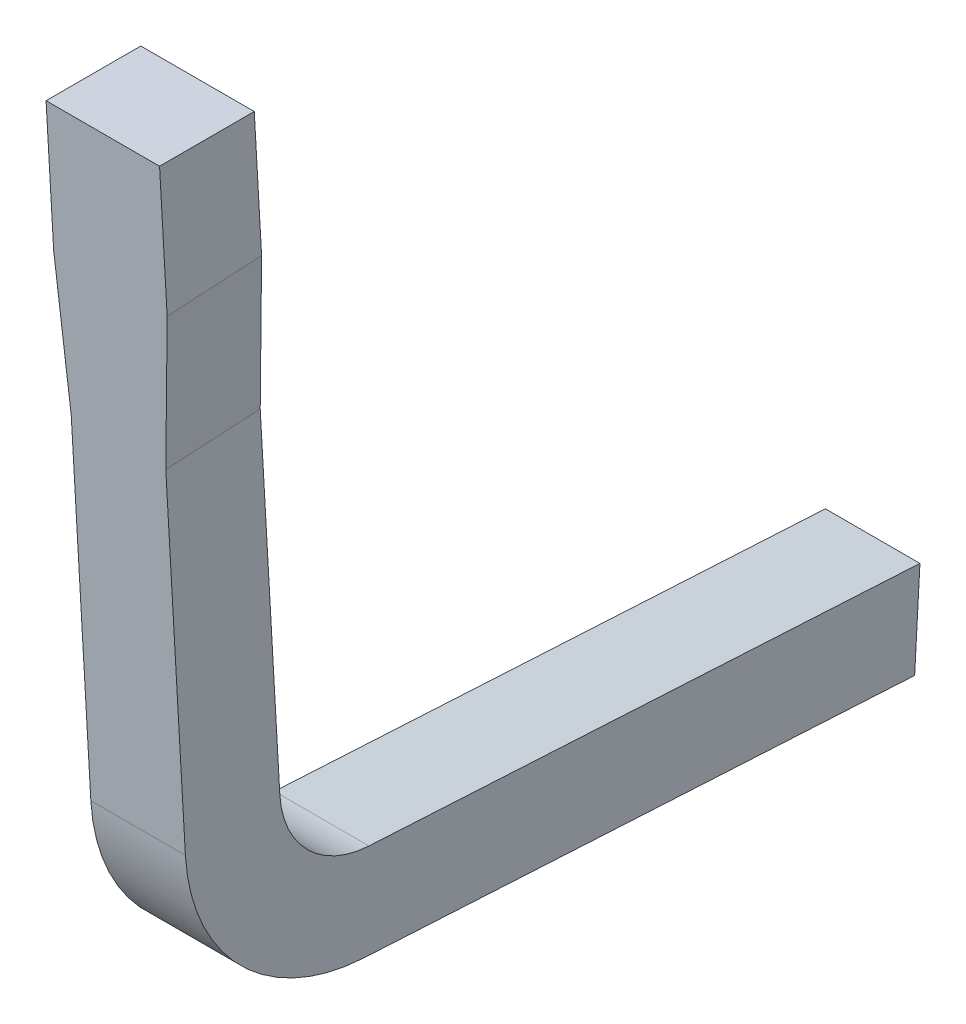
ISO-10303-21;
HEADER;
FILE_DESCRIPTION(('STEP AP214'),'2;1');
FILE_NAME('part.step','',(''),(''),'','','');
FILE_SCHEMA(('AUTOMOTIVE_DESIGN { 1 0 10303 214 1 1 1 1 }'));
ENDSEC;
DATA;
#1=APPLICATION_CONTEXT('core data for automotive mechanical design processes');
#2=APPLICATION_PROTOCOL_DEFINITION('international standard','automotive_design',2000,#1);
#3=PRODUCT_CONTEXT('',#1,'mechanical');
#4=PRODUCT('Part','Part','',(#3));
#5=PRODUCT_RELATED_PRODUCT_CATEGORY('part','',(#4));
#6=PRODUCT_DEFINITION_FORMATION('','',#4);
#7=PRODUCT_DEFINITION_CONTEXT('part definition',#1,'design');
#8=PRODUCT_DEFINITION('design','',#6,#7);
#9=PRODUCT_DEFINITION_SHAPE('','',#8);
#10=(LENGTH_UNIT() NAMED_UNIT(*) SI_UNIT(.MILLI.,.METRE.));
#11=(NAMED_UNIT(*) PLANE_ANGLE_UNIT() SI_UNIT($,.RADIAN.));
#12=(NAMED_UNIT(*) SI_UNIT($,.STERADIAN.) SOLID_ANGLE_UNIT());
#13=UNCERTAINTY_MEASURE_WITH_UNIT(LENGTH_MEASURE(1.E-05),#10,'distance_accuracy_value','');
#14=(GEOMETRIC_REPRESENTATION_CONTEXT(3) GLOBAL_UNCERTAINTY_ASSIGNED_CONTEXT((#13)) GLOBAL_UNIT_ASSIGNED_CONTEXT((#10,
#11,#12)) REPRESENTATION_CONTEXT('',''));
#15=CARTESIAN_POINT('',(0.,0.,0.));
#16=DIRECTION('',(0.,0.,1.));
#17=DIRECTION('',(1.,0.,0.));
#18=AXIS2_PLACEMENT_3D('',#15,#16,#17);
#19=CARTESIAN_POINT('',(-0.12,-1.879082198882,-10.32387202233));
#20=DIRECTION('',(1.,0.,0.));
#21=DIRECTION('',(0.,0.,-1.));
#22=AXIS2_PLACEMENT_3D('',#19,#20,#21);
#23=PLANE('',#22);
#24=DIRECTION('',(1.80045323271721E-13,-0.0569406083160465,0.998377567418559));
#25=VECTOR('',#24,1.);
#26=CARTESIAN_POINT('',(-0.119999999999928,-2.014836222708,-10.43177700759));
#27=LINE('',#26,#25);
#28=CARTESIAN_POINT('',(-0.119999999999976,-2.01483622270795,-10.4317770075908));
#29=VERTEX_POINT('',#28);
#30=CARTESIAN_POINT('',(-0.119999999999964,-2.02622434437118,-10.2321014941066));
#31=VERTEX_POINT('',#30);
#32=EDGE_CURVE('E183',#29,#31,#27,.T.);
#33=ORIENTED_EDGE('',*,*,#32,.T.);
#34=DIRECTION('',(0.,-0.998377567418999,-0.0569406083083299));
#35=VECTOR('',#34,1.);
#36=CARTESIAN_POINT('',(-0.12,-2.398052209196,-10.25330800505));
#37=LINE('',#36,#35);
#38=CARTESIAN_POINT('',(-0.12,-1.74332817505504,-10.2159670370689));
#39=VERTEX_POINT('',#38);
#40=EDGE_CURVE('E180',#39,#31,#37,.T.);
#41=ORIENTED_EDGE('',*,*,#40,.F.);
#42=DIRECTION('',(0.,0.,1.));
#43=VECTOR('',#42,1.);
#44=CARTESIAN_POINT('',(-0.12,-1.743328175055,-10.31612954398));
#45=LINE('',#44,#43);
#46=CARTESIAN_POINT('',(-0.12,-1.74332817505473,-10.4162920508947));
#47=VERTEX_POINT('',#46);
#48=EDGE_CURVE('E175',#47,#39,#45,.T.);
#49=ORIENTED_EDGE('',*,*,#48,.F.);
#50=DIRECTION('',(0.,-0.998377567418624,-0.0569406083148914));
#51=VECTOR('',#50,1.);
#52=CARTESIAN_POINT('',(-0.12,-2.392358148368,-10.45330826871));
#53=LINE('',#52,#51);
#54=EDGE_CURVE('E205',#47,#29,#53,.T.);
#55=ORIENTED_EDGE('',*,*,#54,.T.);
#56=EDGE_LOOP('',(#33,#41,#49,#55));
#57=FACE_BOUND('',#56,.T.);
#58=ADVANCED_FACE('F17',(#57),#23,.F.);
#59=CARTESIAN_POINT('',(-0.1099999999999,-2.170286918652,-10.3404803421));
#60=DIRECTION('',(0.997785157856601,0.0664110879139501,0.003787632923633));
#61=DIRECTION('',(-0.0664115642912273,0.997792315127949,0.));
#62=AXIS2_PLACEMENT_3D('',#59,#60,#61);
#63=PLANE('',#62);
#64=DIRECTION('',(0.0665190105238716,-0.996166318707656,-0.0568144938493808));
#65=VECTOR('',#64,1.);
#66=CARTESIAN_POINT('',(-0.12,-2.02622434437119,-10.2321014941066));
#67=LINE('',#66,#65);
#68=CARTESIAN_POINT('',(-0.0999999999999734,-2.32573761459705,-10.2491836765991));
#69=VERTEX_POINT('',#68);
#70=EDGE_CURVE('E161',#31,#69,#67,.T.);
#71=ORIENTED_EDGE('',*,*,#70,.F.);
#72=ORIENTED_EDGE('',*,*,#32,.F.);
#73=DIRECTION('',(0.0665190105238385,-0.996166318707285,-0.0568144938559237));
#74=VECTOR('',#73,1.);
#75=CARTESIAN_POINT('',(-0.12,-2.01483622270793,-10.4317770075911));
#76=LINE('',#75,#74);
#77=CARTESIAN_POINT('',(-0.09999999999998,-2.31434949293379,-10.4488591900838));
#78=VERTEX_POINT('',#77);
#79=EDGE_CURVE('E115',#29,#78,#76,.T.);
#80=ORIENTED_EDGE('',*,*,#79,.T.);
#81=DIRECTION('',(0.,-0.0569406083160594,0.998377567418558));
#82=VECTOR('',#81,1.);
#83=CARTESIAN_POINT('',(-0.1,-2.314349492934,-10.44885919008));
#84=LINE('',#83,#82);
#85=EDGE_CURVE('E110',#78,#69,#84,.T.);
#86=ORIENTED_EDGE('',*,*,#85,.T.);
#87=EDGE_LOOP('',(#71,#72,#80,#86));
#88=FACE_BOUND('',#87,.T.);
#89=ADVANCED_FACE('F288',(#88),#63,.F.);
#90=CARTESIAN_POINT('',(0.12,-1.879082198882,-10.32387202233));
#91=DIRECTION('',(1.,0.,0.));
#92=DIRECTION('',(0.,0.,-1.));
#93=AXIS2_PLACEMENT_3D('',#90,#91,#92);
#94=PLANE('',#93);
#95=DIRECTION('',(0.,-0.998377567418624,-0.0569406083148914));
#96=VECTOR('',#95,1.);
#97=CARTESIAN_POINT('',(0.12,-2.392358148368,-10.45330826871));
#98=LINE('',#97,#96);
#99=CARTESIAN_POINT('',(0.11999999999996,-2.01483622270897,-10.4317770075904));
#100=VERTEX_POINT('',#99);
#101=CARTESIAN_POINT('',(0.12,-1.74332817505473,-10.4162920508947));
#102=VERTEX_POINT('',#101);
#103=EDGE_CURVE('E128',#100,#102,#98,.F.);
#104=ORIENTED_EDGE('',*,*,#103,.T.);
#105=DIRECTION('',(0.,0.,1.));
#106=VECTOR('',#105,1.);
#107=CARTESIAN_POINT('',(0.12,-1.743328175055,-10.31612954398));
#108=LINE('',#107,#106);
#109=CARTESIAN_POINT('',(0.12,-1.74332817505504,-10.2159670370692));
#110=VERTEX_POINT('',#109);
#111=EDGE_CURVE('E185',#110,#102,#108,.F.);
#112=ORIENTED_EDGE('',*,*,#111,.F.);
#113=DIRECTION('',(0.,-0.998377567418999,-0.0569406083083299));
#114=VECTOR('',#113,1.);
#115=CARTESIAN_POINT('',(0.12,-2.398052209196,-10.25330800505));
#116=LINE('',#115,#114);
#117=CARTESIAN_POINT('',(0.119999999999979,-2.02622434437119,-10.2321014941066));
#118=VERTEX_POINT('',#117);
#119=EDGE_CURVE('E168',#118,#110,#116,.F.);
#120=ORIENTED_EDGE('',*,*,#119,.F.);
#121=DIRECTION('',(0.,-0.0569406083110753,0.998377567418842));
#122=VECTOR('',#121,1.);
#123=CARTESIAN_POINT('',(0.11999999999994,-2.014836222709,-10.43177700759));
#124=LINE('',#123,#122);
#125=EDGE_CURVE('E131',#100,#118,#124,.T.);
#126=ORIENTED_EDGE('',*,*,#125,.F.);
#127=EDGE_LOOP('',(#104,#112,#120,#126));
#128=FACE_BOUND('',#127,.T.);
#129=ADVANCED_FACE('F251',(#128),#94,.T.);
#130=CARTESIAN_POINT('',(0.,-1.743328175055,-10.31612954398));
#131=DIRECTION('',(0.,1.,0.));
#132=DIRECTION('',(0.,0.,1.));
#133=AXIS2_PLACEMENT_3D('',#130,#131,#132);
#134=PLANE('',#133);
#135=DIRECTION('',(1.,0.,0.));
#136=VECTOR('',#135,1.);
#137=CARTESIAN_POINT('',(0.,-1.74332817505459,-10.4162920508971));
#138=LINE('',#137,#136);
#139=EDGE_CURVE('E138',#102,#47,#138,.F.);
#140=ORIENTED_EDGE('',*,*,#139,.T.);
#141=ORIENTED_EDGE('',*,*,#48,.T.);
#142=DIRECTION('',(1.,0.,0.));
#143=VECTOR('',#142,1.);
#144=CARTESIAN_POINT('',(0.,-1.74332817505506,-10.2159670370689));
#145=LINE('',#144,#143);
#146=EDGE_CURVE('E171',#110,#39,#145,.F.);
#147=ORIENTED_EDGE('',*,*,#146,.F.);
#148=ORIENTED_EDGE('',*,*,#111,.T.);
#149=EDGE_LOOP('',(#140,#141,#147,#148));
#150=FACE_BOUND('',#149,.T.);
#151=ADVANCED_FACE('F291',(#150),#134,.T.);
#152=CARTESIAN_POINT('',(-0.1,-2.898875732105,-11.04167004462));
#153=DIRECTION('',(1.,0.,0.));
#154=DIRECTION('',(0.,0.,-1.));
#155=AXIS2_PLACEMENT_3D('',#152,#153,#154);
#156=PLANE('',#155);
#157=CARTESIAN_POINT('',(-0.1,-3.03,-10.69));
#158=DIRECTION('',(-1.,0.,0.));
#159=DIRECTION('',(0.,0.,1.));
#160=AXIS2_PLACEMENT_3D('',#157,#158,#159);
#161=CIRCLE('',#160,0.4);
#162=CARTESIAN_POINT('',(-0.1,-3.05277624332116,-10.2906489730313));
#163=VERTEX_POINT('',#162);
#164=CARTESIAN_POINT('',(-0.1,-3.42937693582933,-10.6676826720305));
#165=VERTEX_POINT('',#164);
#166=EDGE_CURVE('E155',#163,#165,#161,.F.);
#167=ORIENTED_EDGE('',*,*,#166,.F.);
#168=DIRECTION('',(0.,-0.998377567418999,-0.0569406083083299));
#169=VECTOR('',#168,1.);
#170=CARTESIAN_POINT('',(-0.09999999999996,-2.398052209196,-10.25330800505));
#171=LINE('',#170,#169);
#172=EDGE_CURVE('E158',#69,#163,#171,.T.);
#173=ORIENTED_EDGE('',*,*,#172,.F.);
#174=ORIENTED_EDGE('',*,*,#85,.F.);
#175=DIRECTION('',(0.,-0.998377567418624,-0.0569406083148914));
#176=VECTOR('',#175,1.);
#177=CARTESIAN_POINT('',(-0.09999999999997,-2.392358148368,-10.45330826871));
#178=LINE('',#177,#176);
#179=CARTESIAN_POINT('',(-0.099999999999985,-3.0413881216286,-10.4903244865199));
#180=VERTEX_POINT('',#179);
#181=EDGE_CURVE('E104',#78,#180,#178,.T.);
#182=ORIENTED_EDGE('',*,*,#181,.T.);
#183=CARTESIAN_POINT('',(-0.1,-3.03,-10.69));
#184=DIRECTION('',(-1.,0.,0.));
#185=DIRECTION('',(0.,0.,1.));
#186=AXIS2_PLACEMENT_3D('',#183,#184,#185);
#187=CIRCLE('',#186,0.2);
#188=CARTESIAN_POINT('',(-0.1,-3.22968846791482,-10.6788413360177));
#189=VERTEX_POINT('',#188);
#190=EDGE_CURVE('E20',#180,#189,#187,.F.);
#191=ORIENTED_EDGE('',*,*,#190,.T.);
#192=DIRECTION('',(0.,0.0557933199228295,0.998442339572991));
#193=VECTOR('',#192,1.);
#194=CARTESIAN_POINT('',(-0.1,-3.262244863925,-11.26145022621));
#195=LINE('',#194,#193);
#196=CARTESIAN_POINT('',(-0.1,-3.29480125993501,-11.8440591164004));
#197=VERTEX_POINT('',#196);
#198=EDGE_CURVE('E123',#197,#189,#195,.T.);
#199=ORIENTED_EDGE('',*,*,#198,.F.);
#200=DIRECTION('',(0.,-0.998442339574031,0.0557933199042218));
#201=VECTOR('',#200,1.);
#202=CARTESIAN_POINT('',(-0.1,-3.394645493892,-11.83847978441));
#203=LINE('',#202,#201);
#204=CARTESIAN_POINT('',(-0.1,-3.49448972784906,-11.8329004524196));
#205=VERTEX_POINT('',#204);
#206=EDGE_CURVE('E148',#197,#205,#203,.T.);
#207=ORIENTED_EDGE('',*,*,#206,.T.);
#208=DIRECTION('',(0.,0.055793319922371,0.998442339573017));
#209=VECTOR('',#208,1.);
#210=CARTESIAN_POINT('',(-0.1,-3.461933331839,-11.25029156222));
#211=LINE('',#210,#209);
#212=EDGE_CURVE('E153',#205,#165,#211,.T.);
#213=ORIENTED_EDGE('',*,*,#212,.T.);
#214=EDGE_LOOP('',(#167,#173,#174,#182,#191,#199,#207,#213));
#215=FACE_BOUND('',#214,.T.);
#216=ADVANCED_FACE('F107',(#215),#156,.F.);
#217=CARTESIAN_POINT('',(0.,-3.262244863925,-11.26145022621));
#218=DIRECTION('',(0.,0.998442339572991,-0.0557933199228295));
#219=DIRECTION('',(0.,0.0557933199228295,0.998442339572991));
#220=AXIS2_PLACEMENT_3D('',#217,#218,#219);
#221=PLANE('',#220);
#222=DIRECTION('',(0.,0.055793319922887,0.998442339572988));
#223=VECTOR('',#222,1.);
#224=CARTESIAN_POINT('',(0.1,-3.294801259935,-11.8440591164));
#225=LINE('',#224,#223);
#226=CARTESIAN_POINT('',(0.1,-3.29480125993501,-11.8440591164001));
#227=VERTEX_POINT('',#226);
#228=CARTESIAN_POINT('',(0.1,-3.2296884679148,-10.6788413360177));
#229=VERTEX_POINT('',#228);
#230=EDGE_CURVE('E142',#227,#229,#225,.T.);
#231=ORIENTED_EDGE('',*,*,#230,.F.);
#232=DIRECTION('',(1.,0.,0.));
#233=VECTOR('',#232,1.);
#234=CARTESIAN_POINT('',(0.,-3.29480125993502,-11.8440591164004));
#235=LINE('',#234,#233);
#236=EDGE_CURVE('E139',#227,#197,#235,.F.);
#237=ORIENTED_EDGE('',*,*,#236,.T.);
#238=ORIENTED_EDGE('',*,*,#198,.T.);
#239=DIRECTION('',(-1.,0.,0.));
#240=VECTOR('',#239,1.);
#241=CARTESIAN_POINT('',(0.104,-3.22968846791485,-10.67884133602));
#242=LINE('',#241,#240);
#243=EDGE_CURVE('E122',#189,#229,#242,.F.);
#244=ORIENTED_EDGE('',*,*,#243,.T.);
#245=EDGE_LOOP('',(#231,#237,#238,#244));
#246=FACE_BOUND('',#245,.T.);
#247=ADVANCED_FACE('F284',(#246),#221,.T.);
#248=CARTESIAN_POINT('',(0.104,-3.03,-10.69));
#249=DIRECTION('',(-1.,0.,0.));
#250=DIRECTION('',(0.,0.,1.));
#251=AXIS2_PLACEMENT_3D('',#248,#249,#250);
#252=CYLINDRICAL_SURFACE('',#251,0.2);
#253=ORIENTED_EDGE('',*,*,#190,.F.);
#254=DIRECTION('',(1.,0.,0.));
#255=VECTOR('',#254,1.);
#256=CARTESIAN_POINT('',(0.,-3.04138812159455,-10.4903244865179));
#257=LINE('',#256,#255);
#258=CARTESIAN_POINT('',(0.1,-3.04138812162905,-10.4903244865184));
#259=VERTEX_POINT('',#258);
#260=EDGE_CURVE('E114',#180,#259,#257,.T.);
#261=ORIENTED_EDGE('',*,*,#260,.T.);
#262=CARTESIAN_POINT('',(0.1,-3.03,-10.69));
#263=DIRECTION('',(-1.,0.,0.));
#264=DIRECTION('',(0.,0.,1.));
#265=AXIS2_PLACEMENT_3D('',#262,#263,#264);
#266=CIRCLE('',#265,0.2);
#267=EDGE_CURVE('E223',#229,#259,#266,.T.);
#268=ORIENTED_EDGE('',*,*,#267,.F.);
#269=ORIENTED_EDGE('',*,*,#243,.F.);
#270=EDGE_LOOP('',(#253,#261,#268,#269));
#271=FACE_BOUND('',#270,.T.);
#272=ADVANCED_FACE('F119',(#271),#252,.F.);
#273=CARTESIAN_POINT('',(0.,-2.392358148368,-10.45330826871));
#274=DIRECTION('',(0.,-0.0569406083148914,0.998377567418624));
#275=DIRECTION('',(0.,-0.998377567418624,-0.0569406083148914));
#276=AXIS2_PLACEMENT_3D('',#273,#274,#275);
#277=PLANE('',#276);
#278=DIRECTION('',(0.06651901052387,0.996166318708121,0.0568144938412265));
#279=VECTOR('',#278,1.);
#280=CARTESIAN_POINT('',(0.0999999999999666,-2.314349492934,-10.44885919008));
#281=LINE('',#280,#279);
#282=CARTESIAN_POINT('',(0.0999999999999889,-2.314349492934,-10.44885919008));
#283=VERTEX_POINT('',#282);
#284=EDGE_CURVE('E165',#283,#100,#281,.T.);
#285=ORIENTED_EDGE('',*,*,#284,.F.);
#286=DIRECTION('',(0.,0.998377567418421,0.0569406083184697));
#287=VECTOR('',#286,1.);
#288=CARTESIAN_POINT('',(0.1,-3.041388121684,-10.49032448652));
#289=LINE('',#288,#287);
#290=EDGE_CURVE('E126',#259,#283,#289,.T.);
#291=ORIENTED_EDGE('',*,*,#290,.F.);
#292=ORIENTED_EDGE('',*,*,#260,.F.);
#293=ORIENTED_EDGE('',*,*,#181,.F.);
#294=ORIENTED_EDGE('',*,*,#79,.F.);
#295=ORIENTED_EDGE('',*,*,#54,.F.);
#296=ORIENTED_EDGE('',*,*,#139,.F.);
#297=ORIENTED_EDGE('',*,*,#103,.F.);
#298=EDGE_LOOP('',(#285,#291,#292,#293,#294,#295,#296,#297));
#299=FACE_BOUND('',#298,.T.);
#300=ADVANCED_FACE('F124',(#299),#277,.F.);
#301=CARTESIAN_POINT('',(0.1099999999999,-2.170286918653,-10.3404803421));
#302=DIRECTION('',(0.997785157856603,-0.0664110879139302,-0.00378763292347201));
#303=DIRECTION('',(0.0664115642912073,0.99779231512795,0.));
#304=AXIS2_PLACEMENT_3D('',#301,#302,#303);
#305=PLANE('',#304);
#306=DIRECTION('',(0.,-0.0569406083160594,0.998377567418558));
#307=VECTOR('',#306,1.);
#308=CARTESIAN_POINT('',(0.1,-2.314349492934,-10.44885919008));
#309=LINE('',#308,#307);
#310=CARTESIAN_POINT('',(0.0999999999999867,-2.32573761459702,-10.2491836765997));
#311=VERTEX_POINT('',#310);
#312=EDGE_CURVE('E238',#283,#311,#309,.T.);
#313=ORIENTED_EDGE('',*,*,#312,.F.);
#314=ORIENTED_EDGE('',*,*,#284,.T.);
#315=ORIENTED_EDGE('',*,*,#125,.T.);
#316=DIRECTION('',(0.0665190105238716,0.996166318707656,0.0568144938493808));
#317=VECTOR('',#316,1.);
#318=CARTESIAN_POINT('',(0.09999999999996,-2.32573761459705,-10.2491836765991));
#319=LINE('',#318,#317);
#320=EDGE_CURVE('E160',#311,#118,#319,.T.);
#321=ORIENTED_EDGE('',*,*,#320,.F.);
#322=EDGE_LOOP('',(#313,#314,#315,#321));
#323=FACE_BOUND('',#322,.T.);
#324=ADVANCED_FACE('F245',(#323),#305,.T.);
#325=CARTESIAN_POINT('',(0.,-2.398052209196,-10.25330800505));
#326=DIRECTION('',(0.,-0.0569406083083299,0.998377567418999));
#327=DIRECTION('',(0.,-0.998377567418999,-0.0569406083083299));
#328=AXIS2_PLACEMENT_3D('',#325,#326,#327);
#329=PLANE('',#328);
#330=ORIENTED_EDGE('',*,*,#119,.T.);
#331=ORIENTED_EDGE('',*,*,#146,.T.);
#332=ORIENTED_EDGE('',*,*,#40,.T.);
#333=ORIENTED_EDGE('',*,*,#70,.T.);
#334=ORIENTED_EDGE('',*,*,#172,.T.);
#335=DIRECTION('',(-1.,0.,0.));
#336=VECTOR('',#335,1.);
#337=CARTESIAN_POINT('',(0.104,-3.05277624331888,-10.2906489730321));
#338=LINE('',#337,#336);
#339=CARTESIAN_POINT('',(0.1,-3.05277624332089,-10.2906489730312));
#340=VERTEX_POINT('',#339);
#341=EDGE_CURVE('E198',#340,#163,#338,.T.);
#342=ORIENTED_EDGE('',*,*,#341,.F.);
#343=DIRECTION('',(0.,-0.998377567419076,-0.0569406083069694));
#344=VECTOR('',#343,1.);
#345=CARTESIAN_POINT('',(0.1,-2.325737614597,-10.2491836766));
#346=LINE('',#345,#344);
#347=EDGE_CURVE('E222',#311,#340,#346,.T.);
#348=ORIENTED_EDGE('',*,*,#347,.F.);
#349=ORIENTED_EDGE('',*,*,#320,.T.);
#350=EDGE_LOOP('',(#330,#331,#332,#333,#334,#342,#348,#349));
#351=FACE_BOUND('',#350,.T.);
#352=ADVANCED_FACE('F255',(#351),#329,.T.);
#353=CARTESIAN_POINT('',(0.104,-3.03,-10.69));
#354=DIRECTION('',(-1.,0.,0.));
#355=DIRECTION('',(0.,0.,1.));
#356=AXIS2_PLACEMENT_3D('',#353,#354,#355);
#357=CYLINDRICAL_SURFACE('',#356,0.4);
#358=DIRECTION('',(1.,0.,0.));
#359=VECTOR('',#358,1.);
#360=CARTESIAN_POINT('',(0.,-3.4293769358293,-10.66768267203));
#361=LINE('',#360,#359);
#362=CARTESIAN_POINT('',(0.1,-3.42937693582946,-10.6676826720306));
#363=VERTEX_POINT('',#362);
#364=EDGE_CURVE('E150',#165,#363,#361,.T.);
#365=ORIENTED_EDGE('',*,*,#364,.T.);
#366=CARTESIAN_POINT('',(0.1,-3.03,-10.69));
#367=DIRECTION('',(-1.,0.,0.));
#368=DIRECTION('',(0.,0.,1.));
#369=AXIS2_PLACEMENT_3D('',#366,#367,#368);
#370=CIRCLE('',#369,0.4);
#371=EDGE_CURVE('E219',#340,#363,#370,.F.);
#372=ORIENTED_EDGE('',*,*,#371,.F.);
#373=ORIENTED_EDGE('',*,*,#341,.T.);
#374=ORIENTED_EDGE('',*,*,#166,.T.);
#375=EDGE_LOOP('',(#365,#372,#373,#374));
#376=FACE_BOUND('',#375,.T.);
#377=ADVANCED_FACE('F273',(#376),#357,.T.);
#378=CARTESIAN_POINT('',(0.,-3.461933331839,-11.25029156222));
#379=DIRECTION('',(0.,0.998442339573017,-0.055793319922371));
#380=DIRECTION('',(0.,0.055793319922371,0.998442339573017));
#381=AXIS2_PLACEMENT_3D('',#378,#379,#380);
#382=PLANE('',#381);
#383=ORIENTED_EDGE('',*,*,#364,.F.);
#384=ORIENTED_EDGE('',*,*,#212,.F.);
#385=DIRECTION('',(1.,0.,0.));
#386=VECTOR('',#385,1.);
#387=CARTESIAN_POINT('',(0.,-3.49448972784898,-11.8329004524196));
#388=LINE('',#387,#386);
#389=CARTESIAN_POINT('',(0.1,-3.49448972784899,-11.8329004524199));
#390=VERTEX_POINT('',#389);
#391=EDGE_CURVE('E35',#205,#390,#388,.T.);
#392=ORIENTED_EDGE('',*,*,#391,.T.);
#393=DIRECTION('',(0.,-0.0557933199219327,-0.998442339573042));
#394=VECTOR('',#393,1.);
#395=CARTESIAN_POINT('',(0.1,-3.429376935829,-10.66768267202));
#396=LINE('',#395,#394);
#397=EDGE_CURVE('E26',#363,#390,#396,.T.);
#398=ORIENTED_EDGE('',*,*,#397,.F.);
#399=EDGE_LOOP('',(#383,#384,#392,#398));
#400=FACE_BOUND('',#399,.T.);
#401=ADVANCED_FACE('F274',(#400),#382,.F.);
#402=CARTESIAN_POINT('',(0.,-3.394645493892,-11.83847978441));
#403=DIRECTION('',(0.,0.0557933199042218,0.998442339574031));
#404=DIRECTION('',(0.,-0.998442339574031,0.0557933199042218));
#405=AXIS2_PLACEMENT_3D('',#402,#403,#404);
#406=PLANE('',#405);
#407=DIRECTION('',(0.,0.998442339574254,-0.0557933199002383));
#408=VECTOR('',#407,1.);
#409=CARTESIAN_POINT('',(0.1,-3.494489727849,-11.83290045242));
#410=LINE('',#409,#408);
#411=EDGE_CURVE('E11',#390,#227,#410,.T.);
#412=ORIENTED_EDGE('',*,*,#411,.F.);
#413=ORIENTED_EDGE('',*,*,#391,.F.);
#414=ORIENTED_EDGE('',*,*,#206,.F.);
#415=ORIENTED_EDGE('',*,*,#236,.F.);
#416=EDGE_LOOP('',(#412,#413,#414,#415));
#417=FACE_BOUND('',#416,.T.);
#418=ADVANCED_FACE('F281',(#417),#406,.F.);
#419=CARTESIAN_POINT('',(0.1,-2.909472777839,-11.05227927458));
#420=DIRECTION('',(1.,0.,0.));
#421=DIRECTION('',(0.,0.,-1.));
#422=AXIS2_PLACEMENT_3D('',#419,#420,#421);
#423=PLANE('',#422);
#424=ORIENTED_EDGE('',*,*,#397,.T.);
#425=ORIENTED_EDGE('',*,*,#411,.T.);
#426=ORIENTED_EDGE('',*,*,#230,.T.);
#427=ORIENTED_EDGE('',*,*,#267,.T.);
#428=ORIENTED_EDGE('',*,*,#290,.T.);
#429=ORIENTED_EDGE('',*,*,#312,.T.);
#430=ORIENTED_EDGE('',*,*,#347,.T.);
#431=ORIENTED_EDGE('',*,*,#371,.T.);
#432=EDGE_LOOP('',(#424,#425,#426,#427,#428,#429,#430,#431));
#433=FACE_BOUND('',#432,.T.);
#434=ADVANCED_FACE('F260',(#433),#423,.T.);
#435=CLOSED_SHELL('',(#58,#89,#129,#151,#216,#247,#272,#300,#324,#352,#377,#401,#418,#434));
#436=MANIFOLD_SOLID_BREP('B1',#435);
#437=ADVANCED_BREP_SHAPE_REPRESENTATION('',(#18,#436),#14);
#438=SHAPE_DEFINITION_REPRESENTATION(#9,#437);
ENDSEC;
END-ISO-10303-21;
